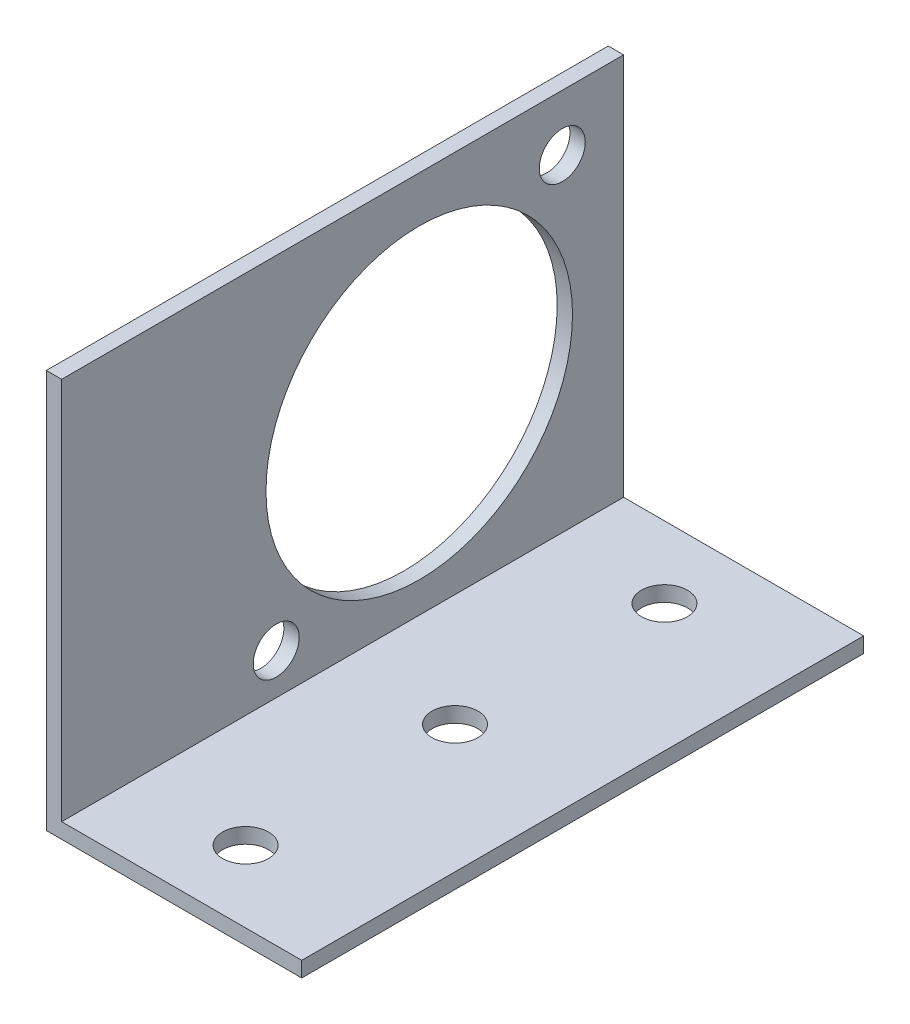
ISO-10303-21;
HEADER;
FILE_DESCRIPTION(('STEP AP214'),'2;1');
FILE_NAME('part.step','',(''),(''),'','','');
FILE_SCHEMA(('AUTOMOTIVE_DESIGN { 1 0 10303 214 1 1 1 1 }'));
ENDSEC;
DATA;
#1=APPLICATION_CONTEXT('core data for automotive mechanical design processes');
#2=APPLICATION_PROTOCOL_DEFINITION('international standard','automotive_design',2000,#1);
#3=PRODUCT_CONTEXT('',#1,'mechanical');
#4=PRODUCT('Part','Part','',(#3));
#5=PRODUCT_RELATED_PRODUCT_CATEGORY('part','',(#4));
#6=PRODUCT_DEFINITION_FORMATION('','',#4);
#7=PRODUCT_DEFINITION_CONTEXT('part definition',#1,'design');
#8=PRODUCT_DEFINITION('design','',#6,#7);
#9=PRODUCT_DEFINITION_SHAPE('','',#8);
#10=(LENGTH_UNIT() NAMED_UNIT(*) SI_UNIT(.MILLI.,.METRE.));
#11=(NAMED_UNIT(*) PLANE_ANGLE_UNIT() SI_UNIT($,.RADIAN.));
#12=(NAMED_UNIT(*) SI_UNIT($,.STERADIAN.) SOLID_ANGLE_UNIT());
#13=UNCERTAINTY_MEASURE_WITH_UNIT(LENGTH_MEASURE(1.E-05),#10,'distance_accuracy_value','');
#14=(GEOMETRIC_REPRESENTATION_CONTEXT(3) GLOBAL_UNCERTAINTY_ASSIGNED_CONTEXT((#13)) GLOBAL_UNIT_ASSIGNED_CONTEXT((#10,
#11,#12)) REPRESENTATION_CONTEXT('',''));
#15=CARTESIAN_POINT('',(0.,0.,0.));
#16=DIRECTION('',(0.,0.,1.));
#17=DIRECTION('',(1.,0.,0.));
#18=AXIS2_PLACEMENT_3D('',#15,#16,#17);
#19=CARTESIAN_POINT('',(1.5,0.,-55.));
#20=DIRECTION('',(1.,0.,0.));
#21=DIRECTION('',(0.,0.,-1.));
#22=AXIS2_PLACEMENT_3D('',#19,#20,#21);
#23=PLANE('',#22);
#24=CARTESIAN_POINT('',(1.5,19.5,-35.));
#25=DIRECTION('',(1.,0.,0.));
#26=DIRECTION('',(0.,0.,-1.));
#27=AXIS2_PLACEMENT_3D('',#24,#25,#26);
#28=CIRCLE('',#27,15.);
#29=CARTESIAN_POINT('',(1.5,19.5,-50.));
#30=VERTEX_POINT('',#29);
#31=EDGE_CURVE('E199',#30,#30,#28,.T.);
#32=ORIENTED_EDGE('',*,*,#31,.F.);
#33=EDGE_LOOP('',(#32));
#34=FACE_BOUND('',#33,.T.);
#35=CARTESIAN_POINT('',(1.5,33.5,-49.));
#36=DIRECTION('',(1.,0.,0.));
#37=DIRECTION('',(0.,0.,-1.));
#38=AXIS2_PLACEMENT_3D('',#35,#36,#37);
#39=CIRCLE('',#38,2.25);
#40=CARTESIAN_POINT('',(1.5,33.5,-51.25));
#41=VERTEX_POINT('',#40);
#42=EDGE_CURVE('E201',#41,#41,#39,.T.);
#43=ORIENTED_EDGE('',*,*,#42,.F.);
#44=EDGE_LOOP('',(#43));
#45=FACE_BOUND('',#44,.T.);
#46=CARTESIAN_POINT('',(1.5,5.5,-21.));
#47=DIRECTION('',(1.,0.,0.));
#48=DIRECTION('',(0.,0.,-1.));
#49=AXIS2_PLACEMENT_3D('',#46,#47,#48);
#50=CIRCLE('',#49,2.25);
#51=CARTESIAN_POINT('',(1.5,5.5,-23.25));
#52=VERTEX_POINT('',#51);
#53=EDGE_CURVE('E209',#52,#52,#50,.T.);
#54=ORIENTED_EDGE('',*,*,#53,.F.);
#55=EDGE_LOOP('',(#54));
#56=FACE_BOUND('',#55,.T.);
#57=DIRECTION('',(0.,1.,0.));
#58=VECTOR('',#57,1.);
#59=CARTESIAN_POINT('',(1.5,0.,0.));
#60=LINE('',#59,#58);
#61=CARTESIAN_POINT('',(1.5,1.5,0.));
#62=VERTEX_POINT('',#61);
#63=CARTESIAN_POINT('',(1.5,39.,0.));
#64=VERTEX_POINT('',#63);
#65=EDGE_CURVE('E113',#62,#64,#60,.T.);
#66=ORIENTED_EDGE('',*,*,#65,.F.);
#67=DIRECTION('',(0.,0.,1.));
#68=VECTOR('',#67,1.);
#69=CARTESIAN_POINT('',(1.5,1.5,-55.));
#70=LINE('',#69,#68);
#71=CARTESIAN_POINT('',(1.5,1.5,-55.));
#72=VERTEX_POINT('',#71);
#73=EDGE_CURVE('E11',#72,#62,#70,.T.);
#74=ORIENTED_EDGE('',*,*,#73,.F.);
#75=DIRECTION('',(0.,1.,0.));
#76=VECTOR('',#75,1.);
#77=CARTESIAN_POINT('',(1.5,0.,-55.));
#78=LINE('',#77,#76);
#79=CARTESIAN_POINT('',(1.5,39.,-55.));
#80=VERTEX_POINT('',#79);
#81=EDGE_CURVE('E127',#72,#80,#78,.T.);
#82=ORIENTED_EDGE('',*,*,#81,.T.);
#83=DIRECTION('',(0.,0.,1.));
#84=VECTOR('',#83,1.);
#85=CARTESIAN_POINT('',(1.5,39.,-55.));
#86=LINE('',#85,#84);
#87=EDGE_CURVE('E34',#80,#64,#86,.T.);
#88=ORIENTED_EDGE('',*,*,#87,.T.);
#89=EDGE_LOOP('',(#66,#74,#82,#88));
#90=FACE_BOUND('',#89,.T.);
#91=ADVANCED_FACE('F31',(#34,#45,#56,#90),#23,.T.);
#92=CARTESIAN_POINT('',(0.,1.5,-55.));
#93=DIRECTION('',(0.,1.,0.));
#94=DIRECTION('',(0.,0.,1.));
#95=AXIS2_PLACEMENT_3D('',#92,#93,#94);
#96=PLANE('',#95);
#97=CARTESIAN_POINT('',(12.5,1.5,-7.));
#98=DIRECTION('',(0.,1.,0.));
#99=DIRECTION('',(0.,0.,1.));
#100=AXIS2_PLACEMENT_3D('',#97,#98,#99);
#101=CIRCLE('',#100,2.25);
#102=CARTESIAN_POINT('',(12.5,1.5,-4.75));
#103=VERTEX_POINT('',#102);
#104=EDGE_CURVE('E215',#103,#103,#101,.T.);
#105=ORIENTED_EDGE('',*,*,#104,.F.);
#106=EDGE_LOOP('',(#105));
#107=FACE_BOUND('',#106,.T.);
#108=CARTESIAN_POINT('',(12.5,1.5,-27.5));
#109=DIRECTION('',(0.,1.,0.));
#110=DIRECTION('',(0.,0.,1.));
#111=AXIS2_PLACEMENT_3D('',#108,#109,#110);
#112=CIRCLE('',#111,2.25);
#113=CARTESIAN_POINT('',(12.5,1.5,-25.25));
#114=VERTEX_POINT('',#113);
#115=EDGE_CURVE('E221',#114,#114,#112,.T.);
#116=ORIENTED_EDGE('',*,*,#115,.F.);
#117=EDGE_LOOP('',(#116));
#118=FACE_BOUND('',#117,.T.);
#119=CARTESIAN_POINT('',(12.5,1.5,-48.));
#120=DIRECTION('',(0.,1.,0.));
#121=DIRECTION('',(0.,0.,1.));
#122=AXIS2_PLACEMENT_3D('',#119,#120,#121);
#123=CIRCLE('',#122,2.25);
#124=CARTESIAN_POINT('',(12.5,1.5,-45.75));
#125=VERTEX_POINT('',#124);
#126=EDGE_CURVE('E227',#125,#125,#123,.T.);
#127=ORIENTED_EDGE('',*,*,#126,.F.);
#128=EDGE_LOOP('',(#127));
#129=FACE_BOUND('',#128,.T.);
#130=DIRECTION('',(1.,0.,0.));
#131=VECTOR('',#130,1.);
#132=CARTESIAN_POINT('',(0.,1.5,0.));
#133=LINE('',#132,#131);
#134=CARTESIAN_POINT('',(25.,1.5,0.));
#135=VERTEX_POINT('',#134);
#136=EDGE_CURVE('E125',#135,#62,#133,.F.);
#137=ORIENTED_EDGE('',*,*,#136,.F.);
#138=DIRECTION('',(0.,0.,1.));
#139=VECTOR('',#138,1.);
#140=CARTESIAN_POINT('',(25.,1.5,-55.));
#141=LINE('',#140,#139);
#142=CARTESIAN_POINT('',(25.,1.5,-55.));
#143=VERTEX_POINT('',#142);
#144=EDGE_CURVE('E40',#143,#135,#141,.T.);
#145=ORIENTED_EDGE('',*,*,#144,.F.);
#146=DIRECTION('',(1.,0.,0.));
#147=VECTOR('',#146,1.);
#148=CARTESIAN_POINT('',(0.,1.5,-55.));
#149=LINE('',#148,#147);
#150=EDGE_CURVE('E94',#143,#72,#149,.F.);
#151=ORIENTED_EDGE('',*,*,#150,.T.);
#152=ORIENTED_EDGE('',*,*,#73,.T.);
#153=EDGE_LOOP('',(#137,#145,#151,#152));
#154=FACE_BOUND('',#153,.T.);
#155=ADVANCED_FACE('F139',(#107,#118,#129,#154),#96,.T.);
#156=CARTESIAN_POINT('',(25.,1.5,-55.));
#157=DIRECTION('',(-1.,0.,0.));
#158=DIRECTION('',(0.,0.,1.));
#159=AXIS2_PLACEMENT_3D('',#156,#157,#158);
#160=PLANE('',#159);
#161=DIRECTION('',(0.,-1.,0.));
#162=VECTOR('',#161,1.);
#163=CARTESIAN_POINT('',(25.,1.5,0.));
#164=LINE('',#163,#162);
#165=CARTESIAN_POINT('',(25.,0.,0.));
#166=VERTEX_POINT('',#165);
#167=EDGE_CURVE('E99',#135,#166,#164,.T.);
#168=ORIENTED_EDGE('',*,*,#167,.T.);
#169=DIRECTION('',(0.,0.,1.));
#170=VECTOR('',#169,1.);
#171=CARTESIAN_POINT('',(25.,0.,-55.));
#172=LINE('',#171,#170);
#173=CARTESIAN_POINT('',(25.,0.,-55.));
#174=VERTEX_POINT('',#173);
#175=EDGE_CURVE('E97',#174,#166,#172,.T.);
#176=ORIENTED_EDGE('',*,*,#175,.F.);
#177=DIRECTION('',(0.,-1.,0.));
#178=VECTOR('',#177,1.);
#179=CARTESIAN_POINT('',(25.,1.5,-55.));
#180=LINE('',#179,#178);
#181=EDGE_CURVE('E88',#143,#174,#180,.T.);
#182=ORIENTED_EDGE('',*,*,#181,.F.);
#183=ORIENTED_EDGE('',*,*,#144,.T.);
#184=EDGE_LOOP('',(#168,#176,#182,#183));
#185=FACE_BOUND('',#184,.T.);
#186=ADVANCED_FACE('F98',(#185),#160,.F.);
#187=CARTESIAN_POINT('',(0.,0.,-55.));
#188=DIRECTION('',(0.,1.,0.));
#189=DIRECTION('',(0.,0.,1.));
#190=AXIS2_PLACEMENT_3D('',#187,#188,#189);
#191=PLANE('',#190);
#192=CARTESIAN_POINT('',(12.5,0.,-7.));
#193=DIRECTION('',(0.,1.,0.));
#194=DIRECTION('',(0.,0.,1.));
#195=AXIS2_PLACEMENT_3D('',#192,#193,#194);
#196=CIRCLE('',#195,2.25);
#197=CARTESIAN_POINT('',(12.5,0.,-4.75));
#198=VERTEX_POINT('',#197);
#199=EDGE_CURVE('E218',#198,#198,#196,.T.);
#200=ORIENTED_EDGE('',*,*,#199,.T.);
#201=EDGE_LOOP('',(#200));
#202=FACE_BOUND('',#201,.T.);
#203=CARTESIAN_POINT('',(12.5,0.,-27.5));
#204=DIRECTION('',(0.,1.,0.));
#205=DIRECTION('',(0.,0.,1.));
#206=AXIS2_PLACEMENT_3D('',#203,#204,#205);
#207=CIRCLE('',#206,2.25);
#208=CARTESIAN_POINT('',(12.5,0.,-25.25));
#209=VERTEX_POINT('',#208);
#210=EDGE_CURVE('E224',#209,#209,#207,.T.);
#211=ORIENTED_EDGE('',*,*,#210,.T.);
#212=EDGE_LOOP('',(#211));
#213=FACE_BOUND('',#212,.T.);
#214=CARTESIAN_POINT('',(12.5,0.,-48.));
#215=DIRECTION('',(0.,1.,0.));
#216=DIRECTION('',(0.,0.,1.));
#217=AXIS2_PLACEMENT_3D('',#214,#215,#216);
#218=CIRCLE('',#217,2.25);
#219=CARTESIAN_POINT('',(12.5,0.,-45.75));
#220=VERTEX_POINT('',#219);
#221=EDGE_CURVE('E117',#220,#220,#218,.T.);
#222=ORIENTED_EDGE('',*,*,#221,.T.);
#223=EDGE_LOOP('',(#222));
#224=FACE_BOUND('',#223,.T.);
#225=DIRECTION('',(-1.,0.,0.));
#226=VECTOR('',#225,1.);
#227=CARTESIAN_POINT('',(0.,0.,0.));
#228=LINE('',#227,#226);
#229=CARTESIAN_POINT('',(0.,0.,0.));
#230=VERTEX_POINT('',#229);
#231=EDGE_CURVE('E122',#166,#230,#228,.T.);
#232=ORIENTED_EDGE('',*,*,#231,.T.);
#233=DIRECTION('',(0.,0.,1.));
#234=VECTOR('',#233,1.);
#235=CARTESIAN_POINT('',(0.,0.,-55.));
#236=LINE('',#235,#234);
#237=CARTESIAN_POINT('',(0.,0.,-55.));
#238=VERTEX_POINT('',#237);
#239=EDGE_CURVE('E102',#238,#230,#236,.T.);
#240=ORIENTED_EDGE('',*,*,#239,.F.);
#241=DIRECTION('',(-1.,0.,0.));
#242=VECTOR('',#241,1.);
#243=CARTESIAN_POINT('',(0.,0.,-55.));
#244=LINE('',#243,#242);
#245=EDGE_CURVE('E92',#174,#238,#244,.T.);
#246=ORIENTED_EDGE('',*,*,#245,.F.);
#247=ORIENTED_EDGE('',*,*,#175,.T.);
#248=EDGE_LOOP('',(#232,#240,#246,#247));
#249=FACE_BOUND('',#248,.T.);
#250=ADVANCED_FACE('F104',(#202,#213,#224,#249),#191,.F.);
#251=CARTESIAN_POINT('',(0.,0.,-55.));
#252=DIRECTION('',(1.,0.,0.));
#253=DIRECTION('',(0.,0.,-1.));
#254=AXIS2_PLACEMENT_3D('',#251,#252,#253);
#255=PLANE('',#254);
#256=CARTESIAN_POINT('',(0.,19.5,-35.));
#257=DIRECTION('',(1.,0.,0.));
#258=DIRECTION('',(0.,0.,-1.));
#259=AXIS2_PLACEMENT_3D('',#256,#257,#258);
#260=CIRCLE('',#259,15.);
#261=CARTESIAN_POINT('',(0.,19.5,-50.));
#262=VERTEX_POINT('',#261);
#263=EDGE_CURVE('E196',#262,#262,#260,.T.);
#264=ORIENTED_EDGE('',*,*,#263,.T.);
#265=EDGE_LOOP('',(#264));
#266=FACE_BOUND('',#265,.T.);
#267=CARTESIAN_POINT('',(0.,33.5,-49.));
#268=DIRECTION('',(1.,0.,0.));
#269=DIRECTION('',(0.,0.,-1.));
#270=AXIS2_PLACEMENT_3D('',#267,#268,#269);
#271=CIRCLE('',#270,2.25);
#272=CARTESIAN_POINT('',(0.,33.5,-51.25));
#273=VERTEX_POINT('',#272);
#274=EDGE_CURVE('E206',#273,#273,#271,.T.);
#275=ORIENTED_EDGE('',*,*,#274,.T.);
#276=EDGE_LOOP('',(#275));
#277=FACE_BOUND('',#276,.T.);
#278=CARTESIAN_POINT('',(0.,5.5,-21.));
#279=DIRECTION('',(1.,0.,0.));
#280=DIRECTION('',(0.,0.,-1.));
#281=AXIS2_PLACEMENT_3D('',#278,#279,#280);
#282=CIRCLE('',#281,2.25);
#283=CARTESIAN_POINT('',(0.,5.5,-23.25));
#284=VERTEX_POINT('',#283);
#285=EDGE_CURVE('E212',#284,#284,#282,.T.);
#286=ORIENTED_EDGE('',*,*,#285,.T.);
#287=EDGE_LOOP('',(#286));
#288=FACE_BOUND('',#287,.T.);
#289=DIRECTION('',(0.,1.,0.));
#290=VECTOR('',#289,1.);
#291=CARTESIAN_POINT('',(0.,0.,0.));
#292=LINE('',#291,#290);
#293=CARTESIAN_POINT('',(0.,39.,0.));
#294=VERTEX_POINT('',#293);
#295=EDGE_CURVE('E120',#230,#294,#292,.T.);
#296=ORIENTED_EDGE('',*,*,#295,.T.);
#297=DIRECTION('',(0.,0.,1.));
#298=VECTOR('',#297,1.);
#299=CARTESIAN_POINT('',(0.,39.,-55.));
#300=LINE('',#299,#298);
#301=CARTESIAN_POINT('',(0.,39.,-55.));
#302=VERTEX_POINT('',#301);
#303=EDGE_CURVE('E130',#302,#294,#300,.T.);
#304=ORIENTED_EDGE('',*,*,#303,.F.);
#305=DIRECTION('',(0.,1.,0.));
#306=VECTOR('',#305,1.);
#307=CARTESIAN_POINT('',(0.,0.,-55.));
#308=LINE('',#307,#306);
#309=EDGE_CURVE('E107',#238,#302,#308,.T.);
#310=ORIENTED_EDGE('',*,*,#309,.F.);
#311=ORIENTED_EDGE('',*,*,#239,.T.);
#312=EDGE_LOOP('',(#296,#304,#310,#311));
#313=FACE_BOUND('',#312,.T.);
#314=ADVANCED_FACE('F156',(#266,#277,#288,#313),#255,.F.);
#315=CARTESIAN_POINT('',(0.,39.,-55.));
#316=DIRECTION('',(0.,-1.,0.));
#317=DIRECTION('',(0.,0.,-1.));
#318=AXIS2_PLACEMENT_3D('',#315,#316,#317);
#319=PLANE('',#318);
#320=DIRECTION('',(1.,0.,0.));
#321=VECTOR('',#320,1.);
#322=CARTESIAN_POINT('',(0.,39.,0.));
#323=LINE('',#322,#321);
#324=EDGE_CURVE('E116',#294,#64,#323,.T.);
#325=ORIENTED_EDGE('',*,*,#324,.T.);
#326=ORIENTED_EDGE('',*,*,#87,.F.);
#327=DIRECTION('',(1.,0.,0.));
#328=VECTOR('',#327,1.);
#329=CARTESIAN_POINT('',(0.,39.,-55.));
#330=LINE('',#329,#328);
#331=EDGE_CURVE('E80',#302,#80,#330,.T.);
#332=ORIENTED_EDGE('',*,*,#331,.F.);
#333=ORIENTED_EDGE('',*,*,#303,.T.);
#334=EDGE_LOOP('',(#325,#326,#332,#333));
#335=FACE_BOUND('',#334,.T.);
#336=ADVANCED_FACE('F135',(#335),#319,.F.);
#337=CARTESIAN_POINT('',(1.5,39.,-55.));
#338=DIRECTION('',(0.,0.,-1.));
#339=DIRECTION('',(-1.,0.,0.));
#340=AXIS2_PLACEMENT_3D('',#337,#338,#339);
#341=PLANE('',#340);
#342=ORIENTED_EDGE('',*,*,#81,.F.);
#343=ORIENTED_EDGE('',*,*,#150,.F.);
#344=ORIENTED_EDGE('',*,*,#181,.T.);
#345=ORIENTED_EDGE('',*,*,#245,.T.);
#346=ORIENTED_EDGE('',*,*,#309,.T.);
#347=ORIENTED_EDGE('',*,*,#331,.T.);
#348=EDGE_LOOP('',(#342,#343,#344,#345,#346,#347));
#349=FACE_BOUND('',#348,.T.);
#350=ADVANCED_FACE('F90',(#349),#341,.T.);
#351=CARTESIAN_POINT('',(1.5,39.,0.));
#352=DIRECTION('',(0.,0.,-1.));
#353=DIRECTION('',(-1.,0.,0.));
#354=AXIS2_PLACEMENT_3D('',#351,#352,#353);
#355=PLANE('',#354);
#356=ORIENTED_EDGE('',*,*,#65,.T.);
#357=ORIENTED_EDGE('',*,*,#324,.F.);
#358=ORIENTED_EDGE('',*,*,#295,.F.);
#359=ORIENTED_EDGE('',*,*,#231,.F.);
#360=ORIENTED_EDGE('',*,*,#167,.F.);
#361=ORIENTED_EDGE('',*,*,#136,.T.);
#362=EDGE_LOOP('',(#356,#357,#358,#359,#360,#361));
#363=FACE_BOUND('',#362,.T.);
#364=ADVANCED_FACE('F138',(#363),#355,.F.);
#365=CARTESIAN_POINT('',(12.5,1.5,-48.));
#366=DIRECTION('',(0.,1.,0.));
#367=DIRECTION('',(0.,0.,1.));
#368=AXIS2_PLACEMENT_3D('',#365,#366,#367);
#369=CYLINDRICAL_SURFACE('',#368,2.25);
#370=ORIENTED_EDGE('',*,*,#221,.F.);
#371=EDGE_LOOP('',(#370));
#372=FACE_BOUND('',#371,.T.);
#373=ORIENTED_EDGE('',*,*,#126,.T.);
#374=EDGE_LOOP('',(#373));
#375=FACE_BOUND('',#374,.T.);
#376=ADVANCED_FACE('F167',(#372,#375),#369,.F.);
#377=CARTESIAN_POINT('',(12.5,1.5,-27.5));
#378=DIRECTION('',(0.,1.,0.));
#379=DIRECTION('',(0.,0.,1.));
#380=AXIS2_PLACEMENT_3D('',#377,#378,#379);
#381=CYLINDRICAL_SURFACE('',#380,2.25);
#382=ORIENTED_EDGE('',*,*,#210,.F.);
#383=EDGE_LOOP('',(#382));
#384=FACE_BOUND('',#383,.T.);
#385=ORIENTED_EDGE('',*,*,#115,.T.);
#386=EDGE_LOOP('',(#385));
#387=FACE_BOUND('',#386,.T.);
#388=ADVANCED_FACE('F171',(#384,#387),#381,.F.);
#389=CARTESIAN_POINT('',(12.5,1.5,-7.));
#390=DIRECTION('',(0.,1.,0.));
#391=DIRECTION('',(0.,0.,1.));
#392=AXIS2_PLACEMENT_3D('',#389,#390,#391);
#393=CYLINDRICAL_SURFACE('',#392,2.25);
#394=ORIENTED_EDGE('',*,*,#199,.F.);
#395=EDGE_LOOP('',(#394));
#396=FACE_BOUND('',#395,.T.);
#397=ORIENTED_EDGE('',*,*,#104,.T.);
#398=EDGE_LOOP('',(#397));
#399=FACE_BOUND('',#398,.T.);
#400=ADVANCED_FACE('F175',(#396,#399),#393,.F.);
#401=CARTESIAN_POINT('',(1.5,5.5,-21.));
#402=DIRECTION('',(1.,0.,0.));
#403=DIRECTION('',(0.,0.,-1.));
#404=AXIS2_PLACEMENT_3D('',#401,#402,#403);
#405=CYLINDRICAL_SURFACE('',#404,2.25);
#406=ORIENTED_EDGE('',*,*,#285,.F.);
#407=EDGE_LOOP('',(#406));
#408=FACE_BOUND('',#407,.T.);
#409=ORIENTED_EDGE('',*,*,#53,.T.);
#410=EDGE_LOOP('',(#409));
#411=FACE_BOUND('',#410,.T.);
#412=ADVANCED_FACE('F179',(#408,#411),#405,.F.);
#413=CARTESIAN_POINT('',(1.5,33.5,-49.));
#414=DIRECTION('',(1.,0.,0.));
#415=DIRECTION('',(0.,0.,-1.));
#416=AXIS2_PLACEMENT_3D('',#413,#414,#415);
#417=CYLINDRICAL_SURFACE('',#416,2.25);
#418=ORIENTED_EDGE('',*,*,#274,.F.);
#419=EDGE_LOOP('',(#418));
#420=FACE_BOUND('',#419,.T.);
#421=ORIENTED_EDGE('',*,*,#42,.T.);
#422=EDGE_LOOP('',(#421));
#423=FACE_BOUND('',#422,.T.);
#424=ADVANCED_FACE('F183',(#420,#423),#417,.F.);
#425=CARTESIAN_POINT('',(1.5,19.5,-35.));
#426=DIRECTION('',(1.,0.,0.));
#427=DIRECTION('',(0.,0.,-1.));
#428=AXIS2_PLACEMENT_3D('',#425,#426,#427);
#429=CYLINDRICAL_SURFACE('',#428,15.);
#430=ORIENTED_EDGE('',*,*,#263,.F.);
#431=EDGE_LOOP('',(#430));
#432=FACE_BOUND('',#431,.T.);
#433=ORIENTED_EDGE('',*,*,#31,.T.);
#434=EDGE_LOOP('',(#433));
#435=FACE_BOUND('',#434,.T.);
#436=ADVANCED_FACE('F187',(#432,#435),#429,.F.);
#437=CLOSED_SHELL('',(#91,#155,#186,#250,#314,#336,#350,#364,#376,#388,#400,#412,#424,#436));
#438=MANIFOLD_SOLID_BREP('B2',#437);
#439=ADVANCED_BREP_SHAPE_REPRESENTATION('',(#18,#438),#14);
#440=SHAPE_DEFINITION_REPRESENTATION(#9,#439);
ENDSEC;
END-ISO-10303-21;
